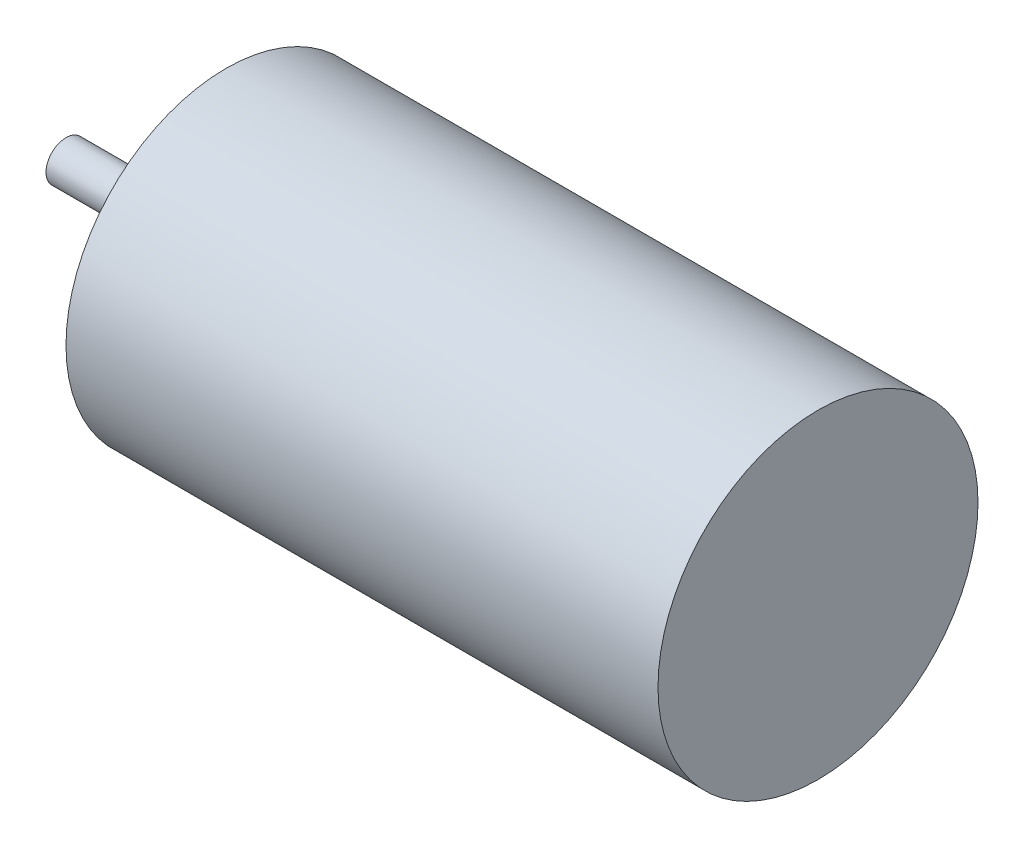
ISO-10303-21;
HEADER;
FILE_DESCRIPTION(('STEP AP214'),'2;1');
FILE_NAME('part.step','',(''),(''),'','','');
FILE_SCHEMA(('AUTOMOTIVE_DESIGN { 1 0 10303 214 1 1 1 1 }'));
ENDSEC;
DATA;
#1=APPLICATION_CONTEXT('core data for automotive mechanical design processes');
#2=APPLICATION_PROTOCOL_DEFINITION('international standard','automotive_design',2000,#1);
#3=PRODUCT_CONTEXT('',#1,'mechanical');
#4=PRODUCT('Part','Part','',(#3));
#5=PRODUCT_RELATED_PRODUCT_CATEGORY('part','',(#4));
#6=PRODUCT_DEFINITION_FORMATION('','',#4);
#7=PRODUCT_DEFINITION_CONTEXT('part definition',#1,'design');
#8=PRODUCT_DEFINITION('design','',#6,#7);
#9=PRODUCT_DEFINITION_SHAPE('','',#8);
#10=(LENGTH_UNIT() NAMED_UNIT(*) SI_UNIT(.MILLI.,.METRE.));
#11=(NAMED_UNIT(*) PLANE_ANGLE_UNIT() SI_UNIT($,.RADIAN.));
#12=(NAMED_UNIT(*) SI_UNIT($,.STERADIAN.) SOLID_ANGLE_UNIT());
#13=UNCERTAINTY_MEASURE_WITH_UNIT(LENGTH_MEASURE(1.E-05),#10,'distance_accuracy_value','');
#14=(GEOMETRIC_REPRESENTATION_CONTEXT(3) GLOBAL_UNCERTAINTY_ASSIGNED_CONTEXT((#13)) GLOBAL_UNIT_ASSIGNED_CONTEXT((#10,
#11,#12)) REPRESENTATION_CONTEXT('',''));
#15=CARTESIAN_POINT('',(0.,0.,0.));
#16=DIRECTION('',(0.,0.,1.));
#17=DIRECTION('',(1.,0.,0.));
#18=AXIS2_PLACEMENT_3D('',#15,#16,#17);
#19=CARTESIAN_POINT('',(0.,0.,0.));
#20=DIRECTION('',(1.,0.,0.));
#21=DIRECTION('',(0.,0.,-1.));
#22=AXIS2_PLACEMENT_3D('',#19,#20,#21);
#23=PLANE('',#22);
#24=CARTESIAN_POINT('',(0.,0.,0.));
#25=DIRECTION('',(1.,0.,0.));
#26=DIRECTION('',(0.,0.,-1.));
#27=AXIS2_PLACEMENT_3D('',#24,#25,#26);
#28=CIRCLE('',#27,20.);
#29=CARTESIAN_POINT('',(0.,0.,-20.));
#30=VERTEX_POINT('',#29);
#31=EDGE_CURVE('E43',#30,#30,#28,.T.);
#32=ORIENTED_EDGE('',*,*,#31,.F.);
#33=EDGE_LOOP('',(#32));
#34=FACE_BOUND('',#33,.T.);
#35=CARTESIAN_POINT('',(0.,0.,0.));
#36=DIRECTION('',(1.,0.,0.));
#37=DIRECTION('',(0.,0.,-1.));
#38=AXIS2_PLACEMENT_3D('',#35,#36,#37);
#39=CIRCLE('',#38,2.5);
#40=CARTESIAN_POINT('',(0.,0.,-2.5));
#41=VERTEX_POINT('',#40);
#42=EDGE_CURVE('E10',#41,#41,#39,.F.);
#43=ORIENTED_EDGE('',*,*,#42,.F.);
#44=EDGE_LOOP('',(#43));
#45=FACE_BOUND('',#44,.T.);
#46=ADVANCED_FACE('F32',(#34,#45),#23,.F.);
#47=CARTESIAN_POINT('',(74.,0.,0.));
#48=DIRECTION('',(-1.,0.,0.));
#49=DIRECTION('',(0.,0.,1.));
#50=AXIS2_PLACEMENT_3D('',#47,#48,#49);
#51=CYLINDRICAL_SURFACE('',#50,20.);
#52=CARTESIAN_POINT('',(74.,0.,0.));
#53=DIRECTION('',(1.,0.,0.));
#54=DIRECTION('',(0.,0.,-1.));
#55=AXIS2_PLACEMENT_3D('',#52,#53,#54);
#56=CIRCLE('',#55,20.);
#57=CARTESIAN_POINT('',(74.,0.,-20.));
#58=VERTEX_POINT('',#57);
#59=EDGE_CURVE('E39',#58,#58,#56,.T.);
#60=ORIENTED_EDGE('',*,*,#59,.F.);
#61=EDGE_LOOP('',(#60));
#62=FACE_BOUND('',#61,.T.);
#63=ORIENTED_EDGE('',*,*,#31,.T.);
#64=EDGE_LOOP('',(#63));
#65=FACE_BOUND('',#64,.T.);
#66=ADVANCED_FACE('F34',(#62,#65),#51,.T.);
#67=CARTESIAN_POINT('',(74.,0.,0.));
#68=DIRECTION('',(1.,0.,0.));
#69=DIRECTION('',(0.,0.,-1.));
#70=AXIS2_PLACEMENT_3D('',#67,#68,#69);
#71=PLANE('',#70);
#72=ORIENTED_EDGE('',*,*,#59,.T.);
#73=EDGE_LOOP('',(#72));
#74=FACE_BOUND('',#73,.T.);
#75=ADVANCED_FACE('F57',(#74),#71,.T.);
#76=CARTESIAN_POINT('',(-20.,0.,0.));
#77=DIRECTION('',(1.,0.,0.));
#78=DIRECTION('',(0.,0.,-1.));
#79=AXIS2_PLACEMENT_3D('',#76,#77,#78);
#80=CYLINDRICAL_SURFACE('',#79,2.5);
#81=CARTESIAN_POINT('',(-20.,0.,0.));
#82=DIRECTION('',(-1.,0.,0.));
#83=DIRECTION('',(0.,0.,1.));
#84=AXIS2_PLACEMENT_3D('',#81,#82,#83);
#85=CIRCLE('',#84,2.5);
#86=CARTESIAN_POINT('',(-20.,0.,2.5));
#87=VERTEX_POINT('',#86);
#88=EDGE_CURVE('E48',#87,#87,#85,.T.);
#89=ORIENTED_EDGE('',*,*,#88,.F.);
#90=EDGE_LOOP('',(#89));
#91=FACE_BOUND('',#90,.T.);
#92=ORIENTED_EDGE('',*,*,#42,.T.);
#93=EDGE_LOOP('',(#92));
#94=FACE_BOUND('',#93,.T.);
#95=ADVANCED_FACE('F55',(#91,#94),#80,.T.);
#96=CARTESIAN_POINT('',(-20.,0.,0.));
#97=DIRECTION('',(-1.,0.,0.));
#98=DIRECTION('',(0.,0.,1.));
#99=AXIS2_PLACEMENT_3D('',#96,#97,#98);
#100=PLANE('',#99);
#101=ORIENTED_EDGE('',*,*,#88,.T.);
#102=EDGE_LOOP('',(#101));
#103=FACE_BOUND('',#102,.T.);
#104=ADVANCED_FACE('F53',(#103),#100,.T.);
#105=CLOSED_SHELL('',(#46,#66,#75,#95,#104));
#106=MANIFOLD_SOLID_BREP('B2',#105);
#107=ADVANCED_BREP_SHAPE_REPRESENTATION('',(#18,#106),#14);
#108=SHAPE_DEFINITION_REPRESENTATION(#9,#107);
ENDSEC;
END-ISO-10303-21;
